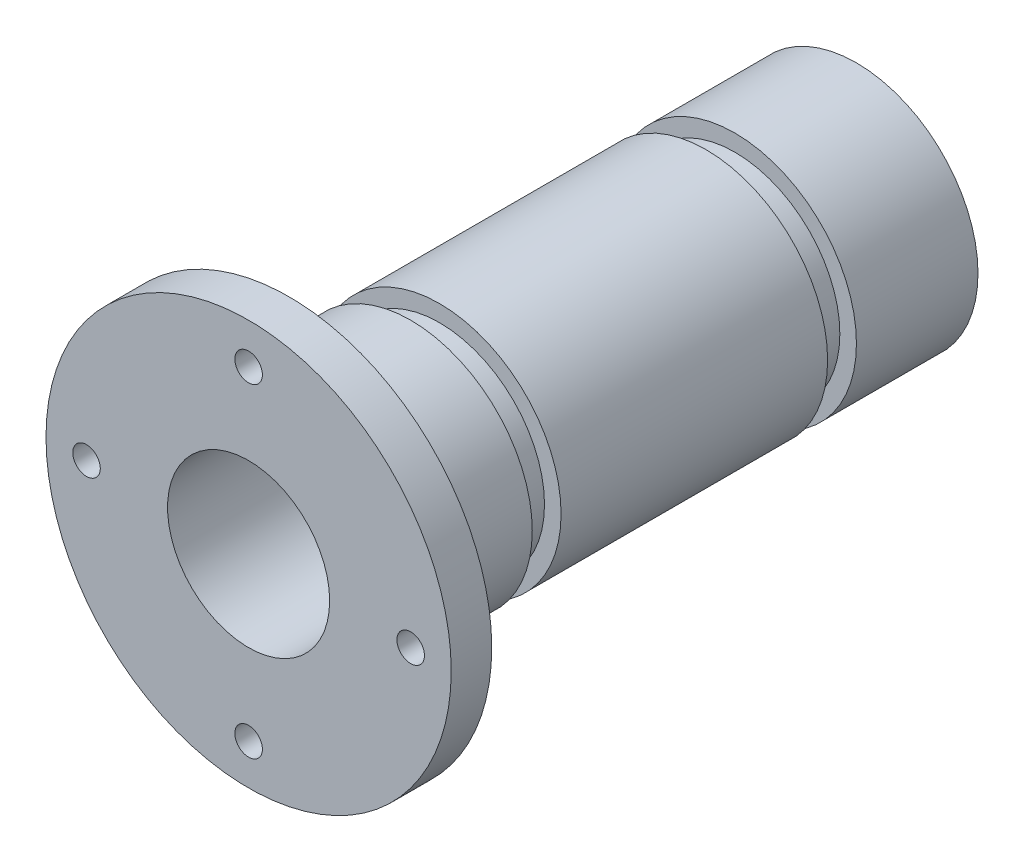
ISO-10303-21;
HEADER;
FILE_DESCRIPTION(('STEP AP214'),'2;1');
FILE_NAME('part.step','',(''),(''),'','','');
FILE_SCHEMA(('AUTOMOTIVE_DESIGN { 1 0 10303 214 1 1 1 1 }'));
ENDSEC;
DATA;
#1=APPLICATION_CONTEXT('core data for automotive mechanical design processes');
#2=APPLICATION_PROTOCOL_DEFINITION('international standard','automotive_design',2000,#1);
#3=PRODUCT_CONTEXT('',#1,'mechanical');
#4=PRODUCT('Part','Part','',(#3));
#5=PRODUCT_RELATED_PRODUCT_CATEGORY('part','',(#4));
#6=PRODUCT_DEFINITION_FORMATION('','',#4);
#7=PRODUCT_DEFINITION_CONTEXT('part definition',#1,'design');
#8=PRODUCT_DEFINITION('design','',#6,#7);
#9=PRODUCT_DEFINITION_SHAPE('','',#8);
#10=(LENGTH_UNIT() NAMED_UNIT(*) SI_UNIT(.MILLI.,.METRE.));
#11=(NAMED_UNIT(*) PLANE_ANGLE_UNIT() SI_UNIT($,.RADIAN.));
#12=(NAMED_UNIT(*) SI_UNIT($,.STERADIAN.) SOLID_ANGLE_UNIT());
#13=UNCERTAINTY_MEASURE_WITH_UNIT(LENGTH_MEASURE(1.E-05),#10,'distance_accuracy_value','');
#14=(GEOMETRIC_REPRESENTATION_CONTEXT(3) GLOBAL_UNCERTAINTY_ASSIGNED_CONTEXT((#13)) GLOBAL_UNIT_ASSIGNED_CONTEXT((#10,
#11,#12)) REPRESENTATION_CONTEXT('',''));
#15=CARTESIAN_POINT('',(0.,0.,0.));
#16=DIRECTION('',(0.,0.,1.));
#17=DIRECTION('',(1.,0.,0.));
#18=AXIS2_PLACEMENT_3D('',#15,#16,#17);
#19=CARTESIAN_POINT('',(0.,0.,35.));
#20=DIRECTION('',(0.,0.,-1.));
#21=DIRECTION('',(-1.,0.,0.));
#22=AXIS2_PLACEMENT_3D('',#19,#20,#21);
#23=CYLINDRICAL_SURFACE('',#22,15.);
#24=CARTESIAN_POINT('',(0.,0.,-16.444));
#25=DIRECTION('',(0.,0.,-1.));
#26=DIRECTION('',(-1.,0.,0.));
#27=AXIS2_PLACEMENT_3D('',#24,#25,#26);
#28=CIRCLE('',#27,15.);
#29=CARTESIAN_POINT('',(-15.,0.,-16.444));
#30=VERTEX_POINT('',#29);
#31=EDGE_CURVE('E69',#30,#30,#28,.T.);
#32=ORIENTED_EDGE('',*,*,#31,.F.);
#33=EDGE_LOOP('',(#32));
#34=FACE_BOUND('',#33,.T.);
#35=CARTESIAN_POINT('',(0.,0.,16.444));
#36=DIRECTION('',(0.,0.,-1.));
#37=DIRECTION('',(-1.,0.,0.));
#38=AXIS2_PLACEMENT_3D('',#35,#36,#37);
#39=CIRCLE('',#38,15.);
#40=CARTESIAN_POINT('',(-15.,0.,16.444));
#41=VERTEX_POINT('',#40);
#42=EDGE_CURVE('E57',#41,#41,#39,.T.);
#43=ORIENTED_EDGE('',*,*,#42,.T.);
#44=EDGE_LOOP('',(#43));
#45=FACE_BOUND('',#44,.T.);
#46=ADVANCED_FACE('F33',(#34,#45),#23,.T.);
#47=CARTESIAN_POINT('',(0.,0.,-20.));
#48=DIRECTION('',(0.,0.,-1.));
#49=DIRECTION('',(-1.,0.,0.));
#50=AXIS2_PLACEMENT_3D('',#47,#48,#49);
#51=CIRCLE('',#50,15.);
#52=CARTESIAN_POINT('',(-15.,0.,-20.));
#53=VERTEX_POINT('',#52);
#54=EDGE_CURVE('E66',#53,#53,#51,.T.);
#55=ORIENTED_EDGE('',*,*,#54,.T.);
#56=EDGE_LOOP('',(#55));
#57=FACE_BOUND('',#56,.T.);
#58=CARTESIAN_POINT('',(0.,0.,-35.));
#59=DIRECTION('',(0.,0.,1.));
#60=DIRECTION('',(1.,0.,0.));
#61=AXIS2_PLACEMENT_3D('',#58,#59,#60);
#62=CIRCLE('',#61,15.);
#63=CARTESIAN_POINT('',(15.,0.,-35.));
#64=VERTEX_POINT('',#63);
#65=EDGE_CURVE('E37',#64,#64,#62,.T.);
#66=ORIENTED_EDGE('',*,*,#65,.T.);
#67=EDGE_LOOP('',(#66));
#68=FACE_BOUND('',#67,.T.);
#69=ADVANCED_FACE('F139',(#57,#68),#23,.T.);
#70=CARTESIAN_POINT('',(0.,0.,-35.));
#71=DIRECTION('',(0.,0.,1.));
#72=DIRECTION('',(1.,0.,0.));
#73=AXIS2_PLACEMENT_3D('',#70,#71,#72);
#74=PLANE('',#73);
#75=ORIENTED_EDGE('',*,*,#65,.F.);
#76=EDGE_LOOP('',(#75));
#77=FACE_BOUND('',#76,.T.);
#78=CARTESIAN_POINT('',(0.,0.,-35.));
#79=DIRECTION('',(0.,0.,1.));
#80=DIRECTION('',(1.,0.,0.));
#81=AXIS2_PLACEMENT_3D('',#78,#79,#80);
#82=CIRCLE('',#81,10.);
#83=CARTESIAN_POINT('',(10.,0.,-35.));
#84=VERTEX_POINT('',#83);
#85=EDGE_CURVE('E44',#84,#84,#82,.T.);
#86=ORIENTED_EDGE('',*,*,#85,.T.);
#87=EDGE_LOOP('',(#86));
#88=FACE_BOUND('',#87,.T.);
#89=ADVANCED_FACE('F137',(#77,#88),#74,.F.);
#90=CARTESIAN_POINT('',(0.,0.,20.));
#91=DIRECTION('',(0.,0.,-1.));
#92=DIRECTION('',(-1.,0.,0.));
#93=AXIS2_PLACEMENT_3D('',#90,#91,#92);
#94=CIRCLE('',#93,15.);
#95=CARTESIAN_POINT('',(-15.,0.,20.));
#96=VERTEX_POINT('',#95);
#97=EDGE_CURVE('E54',#96,#96,#94,.T.);
#98=ORIENTED_EDGE('',*,*,#97,.F.);
#99=EDGE_LOOP('',(#98));
#100=FACE_BOUND('',#99,.T.);
#101=CARTESIAN_POINT('',(0.,0.,35.));
#102=DIRECTION('',(0.,0.,1.));
#103=DIRECTION('',(1.,0.,0.));
#104=AXIS2_PLACEMENT_3D('',#101,#102,#103);
#105=CIRCLE('',#104,15.);
#106=CARTESIAN_POINT('',(15.,0.,35.));
#107=VERTEX_POINT('',#106);
#108=EDGE_CURVE('E10',#107,#107,#105,.T.);
#109=ORIENTED_EDGE('',*,*,#108,.F.);
#110=EDGE_LOOP('',(#109));
#111=FACE_BOUND('',#110,.T.);
#112=ADVANCED_FACE('F35',(#100,#111),#23,.T.);
#113=CARTESIAN_POINT('',(0.,0.,35.));
#114=DIRECTION('',(0.,0.,-1.));
#115=DIRECTION('',(-1.,0.,0.));
#116=AXIS2_PLACEMENT_3D('',#113,#114,#115);
#117=CYLINDRICAL_SURFACE('',#116,10.);
#118=ORIENTED_EDGE('',*,*,#85,.F.);
#119=EDGE_LOOP('',(#118));
#120=FACE_BOUND('',#119,.T.);
#121=CARTESIAN_POINT('',(0.,0.,40.));
#122=DIRECTION('',(0.,0.,1.));
#123=DIRECTION('',(1.,0.,0.));
#124=AXIS2_PLACEMENT_3D('',#121,#122,#123);
#125=CIRCLE('',#124,10.);
#126=CARTESIAN_POINT('',(10.,0.,40.));
#127=VERTEX_POINT('',#126);
#128=EDGE_CURVE('E76',#127,#127,#125,.T.);
#129=ORIENTED_EDGE('',*,*,#128,.T.);
#130=EDGE_LOOP('',(#129));
#131=FACE_BOUND('',#130,.T.);
#132=ADVANCED_FACE('F125',(#120,#131),#117,.F.);
#133=CARTESIAN_POINT('',(0.,15.,16.444));
#134=DIRECTION('',(0.,0.,-1.));
#135=DIRECTION('',(-1.,0.,0.));
#136=AXIS2_PLACEMENT_3D('',#133,#134,#135);
#137=PLANE('',#136);
#138=ORIENTED_EDGE('',*,*,#42,.F.);
#139=EDGE_LOOP('',(#138));
#140=FACE_BOUND('',#139,.T.);
#141=CARTESIAN_POINT('',(0.,0.,16.444));
#142=DIRECTION('',(0.,0.,-1.));
#143=DIRECTION('',(-1.,0.,0.));
#144=AXIS2_PLACEMENT_3D('',#141,#142,#143);
#145=CIRCLE('',#144,12.954);
#146=CARTESIAN_POINT('',(-12.954,0.,16.444));
#147=VERTEX_POINT('',#146);
#148=EDGE_CURVE('E48',#147,#147,#145,.T.);
#149=ORIENTED_EDGE('',*,*,#148,.T.);
#150=EDGE_LOOP('',(#149));
#151=FACE_BOUND('',#150,.T.);
#152=ADVANCED_FACE('F127',(#140,#151),#137,.F.);
#153=CARTESIAN_POINT('',(0.,0.,0.));
#154=DIRECTION('',(0.,0.,-1.));
#155=DIRECTION('',(-1.,0.,0.));
#156=AXIS2_PLACEMENT_3D('',#153,#154,#155);
#157=CYLINDRICAL_SURFACE('',#156,12.954);
#158=ORIENTED_EDGE('',*,*,#148,.F.);
#159=EDGE_LOOP('',(#158));
#160=FACE_BOUND('',#159,.T.);
#161=CARTESIAN_POINT('',(0.,0.,20.));
#162=DIRECTION('',(0.,0.,-1.));
#163=DIRECTION('',(-1.,0.,0.));
#164=AXIS2_PLACEMENT_3D('',#161,#162,#163);
#165=CIRCLE('',#164,12.954);
#166=CARTESIAN_POINT('',(-12.954,0.,20.));
#167=VERTEX_POINT('',#166);
#168=EDGE_CURVE('E51',#167,#167,#165,.T.);
#169=ORIENTED_EDGE('',*,*,#168,.T.);
#170=EDGE_LOOP('',(#169));
#171=FACE_BOUND('',#170,.T.);
#172=ADVANCED_FACE('F134',(#160,#171),#157,.T.);
#173=CARTESIAN_POINT('',(0.,15.,20.));
#174=DIRECTION('',(0.,0.,1.));
#175=DIRECTION('',(1.,0.,0.));
#176=AXIS2_PLACEMENT_3D('',#173,#174,#175);
#177=PLANE('',#176);
#178=ORIENTED_EDGE('',*,*,#168,.F.);
#179=EDGE_LOOP('',(#178));
#180=FACE_BOUND('',#179,.T.);
#181=ORIENTED_EDGE('',*,*,#97,.T.);
#182=EDGE_LOOP('',(#181));
#183=FACE_BOUND('',#182,.T.);
#184=ADVANCED_FACE('F155',(#180,#183),#177,.F.);
#185=CARTESIAN_POINT('',(0.,15.,-16.444));
#186=DIRECTION('',(0.,0.,1.));
#187=DIRECTION('',(-1.,0.,0.));
#188=AXIS2_PLACEMENT_3D('',#185,#186,#187);
#189=PLANE('',#188);
#190=ORIENTED_EDGE('',*,*,#31,.T.);
#191=EDGE_LOOP('',(#190));
#192=FACE_BOUND('',#191,.T.);
#193=CARTESIAN_POINT('',(0.,0.,-16.444));
#194=DIRECTION('',(0.,0.,-1.));
#195=DIRECTION('',(-1.,0.,0.));
#196=AXIS2_PLACEMENT_3D('',#193,#194,#195);
#197=CIRCLE('',#196,12.954);
#198=CARTESIAN_POINT('',(-12.954,0.,-16.444));
#199=VERTEX_POINT('',#198);
#200=EDGE_CURVE('E60',#199,#199,#197,.T.);
#201=ORIENTED_EDGE('',*,*,#200,.F.);
#202=EDGE_LOOP('',(#201));
#203=FACE_BOUND('',#202,.T.);
#204=ADVANCED_FACE('F161',(#192,#203),#189,.F.);
#205=CARTESIAN_POINT('',(0.,0.,0.));
#206=DIRECTION('',(0.,0.,1.));
#207=DIRECTION('',(-1.,0.,0.));
#208=AXIS2_PLACEMENT_3D('',#205,#206,#207);
#209=CYLINDRICAL_SURFACE('',#208,12.954);
#210=ORIENTED_EDGE('',*,*,#200,.T.);
#211=EDGE_LOOP('',(#210));
#212=FACE_BOUND('',#211,.T.);
#213=CARTESIAN_POINT('',(0.,0.,-20.));
#214=DIRECTION('',(0.,0.,-1.));
#215=DIRECTION('',(-1.,0.,0.));
#216=AXIS2_PLACEMENT_3D('',#213,#214,#215);
#217=CIRCLE('',#216,12.954);
#218=CARTESIAN_POINT('',(-12.954,0.,-20.));
#219=VERTEX_POINT('',#218);
#220=EDGE_CURVE('E63',#219,#219,#217,.T.);
#221=ORIENTED_EDGE('',*,*,#220,.F.);
#222=EDGE_LOOP('',(#221));
#223=FACE_BOUND('',#222,.T.);
#224=ADVANCED_FACE('F168',(#212,#223),#209,.T.);
#225=CARTESIAN_POINT('',(0.,15.,-20.));
#226=DIRECTION('',(0.,0.,-1.));
#227=DIRECTION('',(1.,0.,0.));
#228=AXIS2_PLACEMENT_3D('',#225,#226,#227);
#229=PLANE('',#228);
#230=ORIENTED_EDGE('',*,*,#220,.T.);
#231=EDGE_LOOP('',(#230));
#232=FACE_BOUND('',#231,.T.);
#233=ORIENTED_EDGE('',*,*,#54,.F.);
#234=EDGE_LOOP('',(#233));
#235=FACE_BOUND('',#234,.T.);
#236=ADVANCED_FACE('F113',(#232,#235),#229,.F.);
#237=CARTESIAN_POINT('',(0.,0.,40.));
#238=DIRECTION('',(0.,0.,1.));
#239=DIRECTION('',(1.,0.,0.));
#240=AXIS2_PLACEMENT_3D('',#237,#238,#239);
#241=PLANE('',#240);
#242=CARTESIAN_POINT('',(2.09488880330588E-13,-20.,40.));
#243=DIRECTION('',(0.,0.,1.));
#244=DIRECTION('',(1.,0.,0.));
#245=AXIS2_PLACEMENT_3D('',#242,#243,#244);
#246=CIRCLE('',#245,1.7);
#247=CARTESIAN_POINT('',(1.70000000000021,-20.,40.));
#248=VERTEX_POINT('',#247);
#249=EDGE_CURVE('E102',#248,#248,#246,.T.);
#250=ORIENTED_EDGE('',*,*,#249,.F.);
#251=EDGE_LOOP('',(#250));
#252=FACE_BOUND('',#251,.T.);
#253=CARTESIAN_POINT('',(-20.,0.,40.));
#254=DIRECTION('',(0.,0.,1.));
#255=DIRECTION('',(1.,0.,0.));
#256=AXIS2_PLACEMENT_3D('',#253,#254,#255);
#257=CIRCLE('',#256,1.7);
#258=CARTESIAN_POINT('',(-18.3,0.,40.));
#259=VERTEX_POINT('',#258);
#260=EDGE_CURVE('E96',#259,#259,#257,.T.);
#261=ORIENTED_EDGE('',*,*,#260,.F.);
#262=EDGE_LOOP('',(#261));
#263=FACE_BOUND('',#262,.T.);
#264=CARTESIAN_POINT('',(0.,20.,40.));
#265=DIRECTION('',(0.,0.,1.));
#266=DIRECTION('',(1.,0.,0.));
#267=AXIS2_PLACEMENT_3D('',#264,#265,#266);
#268=CIRCLE('',#267,1.7);
#269=CARTESIAN_POINT('',(1.69999999999993,20.,40.));
#270=VERTEX_POINT('',#269);
#271=EDGE_CURVE('E90',#270,#270,#268,.T.);
#272=ORIENTED_EDGE('',*,*,#271,.F.);
#273=EDGE_LOOP('',(#272));
#274=FACE_BOUND('',#273,.T.);
#275=CARTESIAN_POINT('',(20.,0.,40.));
#276=DIRECTION('',(0.,0.,1.));
#277=DIRECTION('',(1.,0.,0.));
#278=AXIS2_PLACEMENT_3D('',#275,#276,#277);
#279=CIRCLE('',#278,1.7);
#280=CARTESIAN_POINT('',(21.7,0.,40.));
#281=VERTEX_POINT('',#280);
#282=EDGE_CURVE('E84',#281,#281,#279,.T.);
#283=ORIENTED_EDGE('',*,*,#282,.F.);
#284=EDGE_LOOP('',(#283));
#285=FACE_BOUND('',#284,.T.);
#286=CARTESIAN_POINT('',(0.,0.,40.));
#287=DIRECTION('',(0.,0.,1.));
#288=DIRECTION('',(1.,0.,0.));
#289=AXIS2_PLACEMENT_3D('',#286,#287,#288);
#290=CIRCLE('',#289,25.);
#291=CARTESIAN_POINT('',(25.,0.,40.));
#292=VERTEX_POINT('',#291);
#293=EDGE_CURVE('E72',#292,#292,#290,.T.);
#294=ORIENTED_EDGE('',*,*,#293,.T.);
#295=EDGE_LOOP('',(#294));
#296=FACE_BOUND('',#295,.T.);
#297=ORIENTED_EDGE('',*,*,#128,.F.);
#298=EDGE_LOOP('',(#297));
#299=FACE_BOUND('',#298,.T.);
#300=ADVANCED_FACE('F109',(#252,#263,#274,#285,#296,#299),#241,.T.);
#301=CARTESIAN_POINT('',(0.,0.,35.));
#302=DIRECTION('',(0.,0.,1.));
#303=DIRECTION('',(1.,0.,0.));
#304=AXIS2_PLACEMENT_3D('',#301,#302,#303);
#305=PLANE('',#304);
#306=CARTESIAN_POINT('',(2.09488880330588E-13,-20.,35.));
#307=DIRECTION('',(0.,0.,1.));
#308=DIRECTION('',(1.,0.,0.));
#309=AXIS2_PLACEMENT_3D('',#306,#307,#308);
#310=CIRCLE('',#309,1.7);
#311=CARTESIAN_POINT('',(1.70000000000021,-20.,35.));
#312=VERTEX_POINT('',#311);
#313=EDGE_CURVE('E99',#312,#312,#310,.T.);
#314=ORIENTED_EDGE('',*,*,#313,.T.);
#315=EDGE_LOOP('',(#314));
#316=FACE_BOUND('',#315,.T.);
#317=CARTESIAN_POINT('',(-20.,0.,35.));
#318=DIRECTION('',(0.,0.,1.));
#319=DIRECTION('',(1.,0.,0.));
#320=AXIS2_PLACEMENT_3D('',#317,#318,#319);
#321=CIRCLE('',#320,1.7);
#322=CARTESIAN_POINT('',(-18.3,0.,35.));
#323=VERTEX_POINT('',#322);
#324=EDGE_CURVE('E93',#323,#323,#321,.T.);
#325=ORIENTED_EDGE('',*,*,#324,.T.);
#326=EDGE_LOOP('',(#325));
#327=FACE_BOUND('',#326,.T.);
#328=CARTESIAN_POINT('',(0.,20.,35.));
#329=DIRECTION('',(0.,0.,1.));
#330=DIRECTION('',(1.,0.,0.));
#331=AXIS2_PLACEMENT_3D('',#328,#329,#330);
#332=CIRCLE('',#331,1.7);
#333=CARTESIAN_POINT('',(1.69999999999993,20.,35.));
#334=VERTEX_POINT('',#333);
#335=EDGE_CURVE('E87',#334,#334,#332,.T.);
#336=ORIENTED_EDGE('',*,*,#335,.T.);
#337=EDGE_LOOP('',(#336));
#338=FACE_BOUND('',#337,.T.);
#339=CARTESIAN_POINT('',(20.,0.,35.));
#340=DIRECTION('',(0.,0.,1.));
#341=DIRECTION('',(1.,0.,0.));
#342=AXIS2_PLACEMENT_3D('',#339,#340,#341);
#343=CIRCLE('',#342,1.7);
#344=CARTESIAN_POINT('',(21.7,0.,35.));
#345=VERTEX_POINT('',#344);
#346=EDGE_CURVE('E81',#345,#345,#343,.T.);
#347=ORIENTED_EDGE('',*,*,#346,.T.);
#348=EDGE_LOOP('',(#347));
#349=FACE_BOUND('',#348,.T.);
#350=ORIENTED_EDGE('',*,*,#108,.T.);
#351=EDGE_LOOP('',(#350));
#352=FACE_BOUND('',#351,.T.);
#353=CARTESIAN_POINT('',(0.,0.,35.));
#354=DIRECTION('',(0.,0.,1.));
#355=DIRECTION('',(1.,0.,0.));
#356=AXIS2_PLACEMENT_3D('',#353,#354,#355);
#357=CIRCLE('',#356,25.);
#358=CARTESIAN_POINT('',(25.,0.,35.));
#359=VERTEX_POINT('',#358);
#360=EDGE_CURVE('E73',#359,#359,#357,.T.);
#361=ORIENTED_EDGE('',*,*,#360,.F.);
#362=EDGE_LOOP('',(#361));
#363=FACE_BOUND('',#362,.T.);
#364=ADVANCED_FACE('F112',(#316,#327,#338,#349,#352,#363),#305,.F.);
#365=CARTESIAN_POINT('',(0.,0.,40.));
#366=DIRECTION('',(0.,0.,-1.));
#367=DIRECTION('',(-1.,0.,0.));
#368=AXIS2_PLACEMENT_3D('',#365,#366,#367);
#369=CYLINDRICAL_SURFACE('',#368,25.);
#370=ORIENTED_EDGE('',*,*,#293,.F.);
#371=EDGE_LOOP('',(#370));
#372=FACE_BOUND('',#371,.T.);
#373=ORIENTED_EDGE('',*,*,#360,.T.);
#374=EDGE_LOOP('',(#373));
#375=FACE_BOUND('',#374,.T.);
#376=ADVANCED_FACE('F178',(#372,#375),#369,.T.);
#377=CARTESIAN_POINT('',(20.,0.,40.));
#378=DIRECTION('',(0.,0.,1.));
#379=DIRECTION('',(1.,0.,0.));
#380=AXIS2_PLACEMENT_3D('',#377,#378,#379);
#381=CYLINDRICAL_SURFACE('',#380,1.7);
#382=ORIENTED_EDGE('',*,*,#282,.T.);
#383=EDGE_LOOP('',(#382));
#384=FACE_BOUND('',#383,.T.);
#385=ORIENTED_EDGE('',*,*,#346,.F.);
#386=EDGE_LOOP('',(#385));
#387=FACE_BOUND('',#386,.T.);
#388=ADVANCED_FACE('F181',(#384,#387),#381,.F.);
#389=CARTESIAN_POINT('',(0.,20.,40.));
#390=DIRECTION('',(0.,0.,1.));
#391=DIRECTION('',(1.,0.,0.));
#392=AXIS2_PLACEMENT_3D('',#389,#390,#391);
#393=CYLINDRICAL_SURFACE('',#392,1.7);
#394=ORIENTED_EDGE('',*,*,#271,.T.);
#395=EDGE_LOOP('',(#394));
#396=FACE_BOUND('',#395,.T.);
#397=ORIENTED_EDGE('',*,*,#335,.F.);
#398=EDGE_LOOP('',(#397));
#399=FACE_BOUND('',#398,.T.);
#400=ADVANCED_FACE('F188',(#396,#399),#393,.F.);
#401=CARTESIAN_POINT('',(-20.,0.,40.));
#402=DIRECTION('',(0.,0.,1.));
#403=DIRECTION('',(1.,0.,0.));
#404=AXIS2_PLACEMENT_3D('',#401,#402,#403);
#405=CYLINDRICAL_SURFACE('',#404,1.7);
#406=ORIENTED_EDGE('',*,*,#260,.T.);
#407=EDGE_LOOP('',(#406));
#408=FACE_BOUND('',#407,.T.);
#409=ORIENTED_EDGE('',*,*,#324,.F.);
#410=EDGE_LOOP('',(#409));
#411=FACE_BOUND('',#410,.T.);
#412=ADVANCED_FACE('F192',(#408,#411),#405,.F.);
#413=CARTESIAN_POINT('',(2.09488880330588E-13,-20.,40.));
#414=DIRECTION('',(0.,0.,1.));
#415=DIRECTION('',(1.,0.,0.));
#416=AXIS2_PLACEMENT_3D('',#413,#414,#415);
#417=CYLINDRICAL_SURFACE('',#416,1.7);
#418=ORIENTED_EDGE('',*,*,#249,.T.);
#419=EDGE_LOOP('',(#418));
#420=FACE_BOUND('',#419,.T.);
#421=ORIENTED_EDGE('',*,*,#313,.F.);
#422=EDGE_LOOP('',(#421));
#423=FACE_BOUND('',#422,.T.);
#424=ADVANCED_FACE('F106',(#420,#423),#417,.F.);
#425=CLOSED_SHELL('',(#46,#69,#89,#112,#132,#152,#172,#184,#204,#224,#236,#300,#364,#376,#388,
#400,#412,#424));
#426=MANIFOLD_SOLID_BREP('B2',#425);
#427=ADVANCED_BREP_SHAPE_REPRESENTATION('',(#18,#426),#14);
#428=SHAPE_DEFINITION_REPRESENTATION(#9,#427);
ENDSEC;
END-ISO-10303-21;
